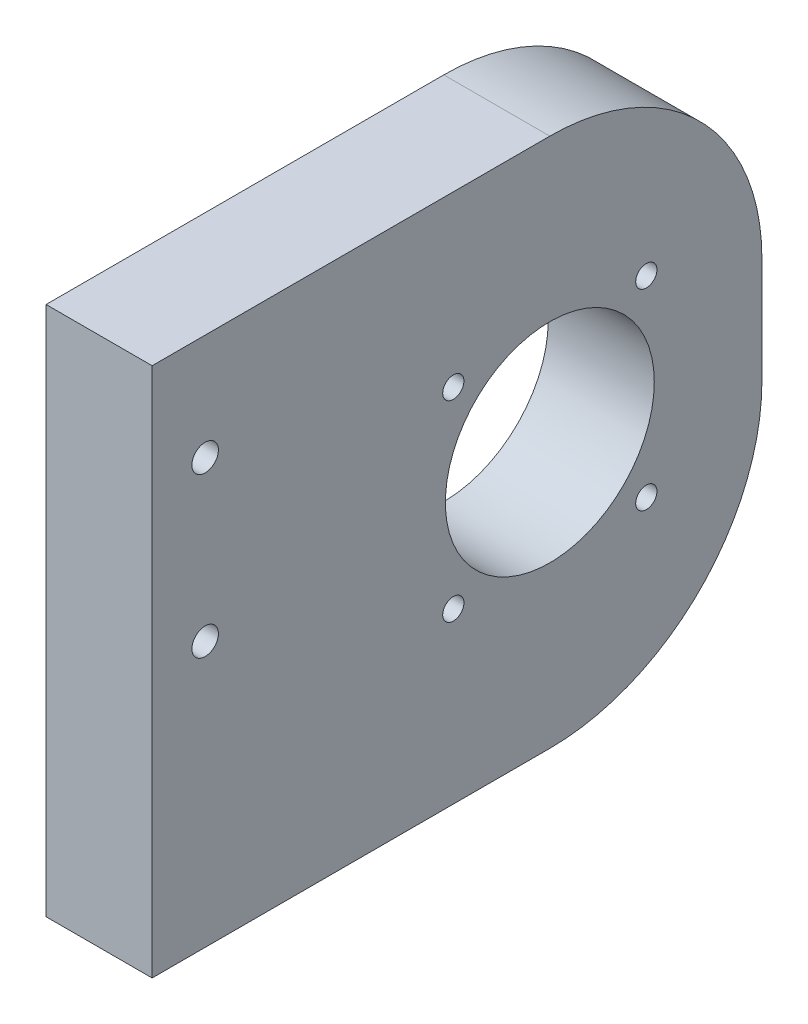
ISO-10303-21;
HEADER;
FILE_DESCRIPTION(('STEP AP214'),'2;1');
FILE_NAME('part.step','',(''),(''),'','','');
FILE_SCHEMA(('AUTOMOTIVE_DESIGN { 1 0 10303 214 1 1 1 1 }'));
ENDSEC;
DATA;
#1=APPLICATION_CONTEXT('core data for automotive mechanical design processes');
#2=APPLICATION_PROTOCOL_DEFINITION('international standard','automotive_design',2000,#1);
#3=PRODUCT_CONTEXT('',#1,'mechanical');
#4=PRODUCT('Part','Part','',(#3));
#5=PRODUCT_RELATED_PRODUCT_CATEGORY('part','',(#4));
#6=PRODUCT_DEFINITION_FORMATION('','',#4);
#7=PRODUCT_DEFINITION_CONTEXT('part definition',#1,'design');
#8=PRODUCT_DEFINITION('design','',#6,#7);
#9=PRODUCT_DEFINITION_SHAPE('','',#8);
#10=(LENGTH_UNIT() NAMED_UNIT(*) SI_UNIT(.MILLI.,.METRE.));
#11=(NAMED_UNIT(*) PLANE_ANGLE_UNIT() SI_UNIT($,.RADIAN.));
#12=(NAMED_UNIT(*) SI_UNIT($,.STERADIAN.) SOLID_ANGLE_UNIT());
#13=UNCERTAINTY_MEASURE_WITH_UNIT(LENGTH_MEASURE(1.E-05),#10,'distance_accuracy_value','');
#14=(GEOMETRIC_REPRESENTATION_CONTEXT(3) GLOBAL_UNCERTAINTY_ASSIGNED_CONTEXT((#13)) GLOBAL_UNIT_ASSIGNED_CONTEXT((#10,
#11,#12)) REPRESENTATION_CONTEXT('',''));
#15=CARTESIAN_POINT('',(0.,0.,0.));
#16=DIRECTION('',(0.,0.,1.));
#17=DIRECTION('',(1.,0.,0.));
#18=AXIS2_PLACEMENT_3D('',#15,#16,#17);
#19=CARTESIAN_POINT('',(0.,0.,146.05));
#20=DIRECTION('',(1.,0.,0.));
#21=DIRECTION('',(0.,0.,-1.));
#22=AXIS2_PLACEMENT_3D('',#19,#20,#21);
#23=PLANE('',#22);
#24=CARTESIAN_POINT('',(0.,101.6,133.35));
#25=DIRECTION('',(1.,0.,0.));
#26=DIRECTION('',(0.,0.,-1.));
#27=AXIS2_PLACEMENT_3D('',#24,#25,#26);
#28=CIRCLE('',#27,3.175);
#29=CARTESIAN_POINT('',(0.,101.6,130.175));
#30=VERTEX_POINT('',#29);
#31=EDGE_CURVE('E154',#30,#30,#28,.F.);
#32=ORIENTED_EDGE('',*,*,#31,.F.);
#33=EDGE_LOOP('',(#32));
#34=FACE_BOUND('',#33,.T.);
#35=CARTESIAN_POINT('',(0.,40.513,73.914));
#36=DIRECTION('',(1.,0.,0.));
#37=DIRECTION('',(0.,0.,-1.));
#38=AXIS2_PLACEMENT_3D('',#35,#36,#37);
#39=CIRCLE('',#38,2.54);
#40=CARTESIAN_POINT('',(0.,40.513,71.374));
#41=VERTEX_POINT('',#40);
#42=EDGE_CURVE('E194',#41,#41,#39,.F.);
#43=ORIENTED_EDGE('',*,*,#42,.F.);
#44=EDGE_LOOP('',(#43));
#45=FACE_BOUND('',#44,.T.);
#46=CARTESIAN_POINT('',(0.,40.513,27.686));
#47=DIRECTION('',(1.,0.,0.));
#48=DIRECTION('',(0.,0.,-1.));
#49=AXIS2_PLACEMENT_3D('',#46,#47,#48);
#50=CIRCLE('',#49,2.54);
#51=CARTESIAN_POINT('',(0.,40.513,25.146));
#52=VERTEX_POINT('',#51);
#53=EDGE_CURVE('E189',#52,#52,#50,.F.);
#54=ORIENTED_EDGE('',*,*,#53,.F.);
#55=EDGE_LOOP('',(#54));
#56=FACE_BOUND('',#55,.T.);
#57=CARTESIAN_POINT('',(0.,63.5,133.35));
#58=DIRECTION('',(1.,0.,0.));
#59=DIRECTION('',(0.,0.,-1.));
#60=AXIS2_PLACEMENT_3D('',#57,#58,#59);
#61=CIRCLE('',#60,3.175);
#62=CARTESIAN_POINT('',(0.,63.5,130.175));
#63=VERTEX_POINT('',#62);
#64=EDGE_CURVE('E176',#63,#63,#61,.F.);
#65=ORIENTED_EDGE('',*,*,#64,.F.);
#66=EDGE_LOOP('',(#65));
#67=FACE_BOUND('',#66,.T.);
#68=CARTESIAN_POINT('',(0.,63.5,50.8));
#69=DIRECTION('',(1.,0.,0.));
#70=DIRECTION('',(0.,0.,-1.));
#71=AXIS2_PLACEMENT_3D('',#68,#69,#70);
#72=CIRCLE('',#71,25.019);
#73=CARTESIAN_POINT('',(0.,63.5,25.781));
#74=VERTEX_POINT('',#73);
#75=EDGE_CURVE('E168',#74,#74,#72,.F.);
#76=ORIENTED_EDGE('',*,*,#75,.F.);
#77=EDGE_LOOP('',(#76));
#78=FACE_BOUND('',#77,.T.);
#79=CARTESIAN_POINT('',(0.,86.487,73.914));
#80=DIRECTION('',(1.,0.,0.));
#81=DIRECTION('',(0.,0.,-1.));
#82=AXIS2_PLACEMENT_3D('',#79,#80,#81);
#83=CIRCLE('',#82,2.53999999999999);
#84=CARTESIAN_POINT('',(0.,86.487,71.374));
#85=VERTEX_POINT('',#84);
#86=EDGE_CURVE('E175',#85,#85,#83,.F.);
#87=ORIENTED_EDGE('',*,*,#86,.F.);
#88=EDGE_LOOP('',(#87));
#89=FACE_BOUND('',#88,.T.);
#90=CARTESIAN_POINT('',(0.,86.487,27.686));
#91=DIRECTION('',(1.,0.,0.));
#92=DIRECTION('',(0.,0.,-1.));
#93=AXIS2_PLACEMENT_3D('',#90,#91,#92);
#94=CIRCLE('',#93,2.54);
#95=CARTESIAN_POINT('',(0.,86.487,25.146));
#96=VERTEX_POINT('',#95);
#97=EDGE_CURVE('E182',#96,#96,#94,.F.);
#98=ORIENTED_EDGE('',*,*,#97,.F.);
#99=EDGE_LOOP('',(#98));
#100=FACE_BOUND('',#99,.T.);
#101=DIRECTION('',(0.,-1.,0.));
#102=VECTOR('',#101,1.);
#103=CARTESIAN_POINT('',(0.,0.,0.));
#104=LINE('',#103,#102);
#105=CARTESIAN_POINT('',(0.,76.2,0.));
#106=VERTEX_POINT('',#105);
#107=CARTESIAN_POINT('',(0.,50.8,0.));
#108=VERTEX_POINT('',#107);
#109=EDGE_CURVE('E150',#106,#108,#104,.T.);
#110=ORIENTED_EDGE('',*,*,#109,.T.);
#111=CARTESIAN_POINT('',(0.,50.8,50.8));
#112=DIRECTION('',(1.,0.,0.));
#113=DIRECTION('',(0.,0.,-1.));
#114=AXIS2_PLACEMENT_3D('',#111,#112,#113);
#115=CIRCLE('',#114,50.8);
#116=CARTESIAN_POINT('',(0.,0.,50.8));
#117=VERTEX_POINT('',#116);
#118=EDGE_CURVE('E65',#108,#117,#115,.F.);
#119=ORIENTED_EDGE('',*,*,#118,.T.);
#120=DIRECTION('',(0.,0.,-1.));
#121=VECTOR('',#120,1.);
#122=CARTESIAN_POINT('',(0.,0.,146.05));
#123=LINE('',#122,#121);
#124=CARTESIAN_POINT('',(0.,0.,146.05));
#125=VERTEX_POINT('',#124);
#126=EDGE_CURVE('E117',#125,#117,#123,.T.);
#127=ORIENTED_EDGE('',*,*,#126,.F.);
#128=DIRECTION('',(0.,-1.,0.));
#129=VECTOR('',#128,1.);
#130=CARTESIAN_POINT('',(0.,0.,146.05));
#131=LINE('',#130,#129);
#132=CARTESIAN_POINT('',(0.,127.,146.05));
#133=VERTEX_POINT('',#132);
#134=EDGE_CURVE('E124',#133,#125,#131,.T.);
#135=ORIENTED_EDGE('',*,*,#134,.F.);
#136=DIRECTION('',(0.,0.,-1.));
#137=VECTOR('',#136,1.);
#138=CARTESIAN_POINT('',(0.,127.,146.05));
#139=LINE('',#138,#137);
#140=CARTESIAN_POINT('',(0.,127.,50.8));
#141=VERTEX_POINT('',#140);
#142=EDGE_CURVE('E151',#133,#141,#139,.T.);
#143=ORIENTED_EDGE('',*,*,#142,.T.);
#144=CARTESIAN_POINT('',(0.,76.2,50.8));
#145=DIRECTION('',(1.,0.,0.));
#146=DIRECTION('',(0.,0.,-1.));
#147=AXIS2_PLACEMENT_3D('',#144,#145,#146);
#148=CIRCLE('',#147,50.8);
#149=EDGE_CURVE('E72',#141,#106,#148,.F.);
#150=ORIENTED_EDGE('',*,*,#149,.T.);
#151=EDGE_LOOP('',(#110,#119,#127,#135,#143,#150));
#152=FACE_BOUND('',#151,.T.);
#153=ADVANCED_FACE('F57',(#34,#45,#56,#67,#78,#89,#100,#152),#23,.F.);
#154=CARTESIAN_POINT('',(0.,0.,146.05));
#155=DIRECTION('',(0.,1.,0.));
#156=DIRECTION('',(0.,0.,1.));
#157=AXIS2_PLACEMENT_3D('',#154,#155,#156);
#158=PLANE('',#157);
#159=ORIENTED_EDGE('',*,*,#126,.T.);
#160=DIRECTION('',(1.,0.,0.));
#161=VECTOR('',#160,1.);
#162=CARTESIAN_POINT('',(25.4,0.,50.8));
#163=LINE('',#162,#161);
#164=CARTESIAN_POINT('',(25.4,0.,50.8));
#165=VERTEX_POINT('',#164);
#166=EDGE_CURVE('E136',#117,#165,#163,.T.);
#167=ORIENTED_EDGE('',*,*,#166,.T.);
#168=DIRECTION('',(0.,0.,-1.));
#169=VECTOR('',#168,1.);
#170=CARTESIAN_POINT('',(25.4,0.,146.05));
#171=LINE('',#170,#169);
#172=CARTESIAN_POINT('',(25.4,0.,146.05));
#173=VERTEX_POINT('',#172);
#174=EDGE_CURVE('E120',#173,#165,#171,.T.);
#175=ORIENTED_EDGE('',*,*,#174,.F.);
#176=DIRECTION('',(1.,0.,0.));
#177=VECTOR('',#176,1.);
#178=CARTESIAN_POINT('',(0.,0.,146.05));
#179=LINE('',#178,#177);
#180=EDGE_CURVE('E112',#125,#173,#179,.T.);
#181=ORIENTED_EDGE('',*,*,#180,.F.);
#182=EDGE_LOOP('',(#159,#167,#175,#181));
#183=FACE_BOUND('',#182,.T.);
#184=ADVANCED_FACE('F114',(#183),#158,.F.);
#185=CARTESIAN_POINT('',(25.4,0.,146.05));
#186=DIRECTION('',(-1.,0.,0.));
#187=DIRECTION('',(0.,0.,1.));
#188=AXIS2_PLACEMENT_3D('',#185,#186,#187);
#189=PLANE('',#188);
#190=CARTESIAN_POINT('',(25.4,101.6,133.35));
#191=DIRECTION('',(1.,0.,0.));
#192=DIRECTION('',(0.,0.,-1.));
#193=AXIS2_PLACEMENT_3D('',#190,#191,#192);
#194=CIRCLE('',#193,3.175);
#195=CARTESIAN_POINT('',(25.4,101.6,130.175));
#196=VERTEX_POINT('',#195);
#197=EDGE_CURVE('E179',#196,#196,#194,.T.);
#198=ORIENTED_EDGE('',*,*,#197,.F.);
#199=EDGE_LOOP('',(#198));
#200=FACE_BOUND('',#199,.T.);
#201=CARTESIAN_POINT('',(25.4,40.513,73.914));
#202=DIRECTION('',(1.,0.,0.));
#203=DIRECTION('',(0.,0.,-1.));
#204=AXIS2_PLACEMENT_3D('',#201,#202,#203);
#205=CIRCLE('',#204,2.54);
#206=CARTESIAN_POINT('',(25.4,40.513,71.374));
#207=VERTEX_POINT('',#206);
#208=EDGE_CURVE('E198',#207,#207,#205,.T.);
#209=ORIENTED_EDGE('',*,*,#208,.F.);
#210=EDGE_LOOP('',(#209));
#211=FACE_BOUND('',#210,.T.);
#212=CARTESIAN_POINT('',(25.4,40.513,27.686));
#213=DIRECTION('',(1.,0.,0.));
#214=DIRECTION('',(0.,0.,-1.));
#215=AXIS2_PLACEMENT_3D('',#212,#213,#214);
#216=CIRCLE('',#215,2.54);
#217=CARTESIAN_POINT('',(25.4,40.513,25.146));
#218=VERTEX_POINT('',#217);
#219=EDGE_CURVE('E197',#218,#218,#216,.T.);
#220=ORIENTED_EDGE('',*,*,#219,.F.);
#221=EDGE_LOOP('',(#220));
#222=FACE_BOUND('',#221,.T.);
#223=CARTESIAN_POINT('',(25.4,63.5,133.35));
#224=DIRECTION('',(1.,0.,0.));
#225=DIRECTION('',(0.,0.,-1.));
#226=AXIS2_PLACEMENT_3D('',#223,#224,#225);
#227=CIRCLE('',#226,3.175);
#228=CARTESIAN_POINT('',(25.4,63.5,130.175));
#229=VERTEX_POINT('',#228);
#230=EDGE_CURVE('E171',#229,#229,#227,.T.);
#231=ORIENTED_EDGE('',*,*,#230,.F.);
#232=EDGE_LOOP('',(#231));
#233=FACE_BOUND('',#232,.T.);
#234=CARTESIAN_POINT('',(25.4,63.5,50.8));
#235=DIRECTION('',(1.,0.,0.));
#236=DIRECTION('',(0.,0.,-1.));
#237=AXIS2_PLACEMENT_3D('',#234,#235,#236);
#238=CIRCLE('',#237,25.019);
#239=CARTESIAN_POINT('',(25.4,63.5,25.781));
#240=VERTEX_POINT('',#239);
#241=EDGE_CURVE('E172',#240,#240,#238,.T.);
#242=ORIENTED_EDGE('',*,*,#241,.F.);
#243=EDGE_LOOP('',(#242));
#244=FACE_BOUND('',#243,.T.);
#245=CARTESIAN_POINT('',(25.4,86.487,73.914));
#246=DIRECTION('',(1.,0.,0.));
#247=DIRECTION('',(0.,0.,-1.));
#248=AXIS2_PLACEMENT_3D('',#245,#246,#247);
#249=CIRCLE('',#248,2.53999999999999);
#250=CARTESIAN_POINT('',(25.4,86.487,71.374));
#251=VERTEX_POINT('',#250);
#252=EDGE_CURVE('E185',#251,#251,#249,.T.);
#253=ORIENTED_EDGE('',*,*,#252,.F.);
#254=EDGE_LOOP('',(#253));
#255=FACE_BOUND('',#254,.T.);
#256=CARTESIAN_POINT('',(25.4,86.487,27.686));
#257=DIRECTION('',(1.,0.,0.));
#258=DIRECTION('',(0.,0.,-1.));
#259=AXIS2_PLACEMENT_3D('',#256,#257,#258);
#260=CIRCLE('',#259,2.54);
#261=CARTESIAN_POINT('',(25.4,86.487,25.146));
#262=VERTEX_POINT('',#261);
#263=EDGE_CURVE('E186',#262,#262,#260,.T.);
#264=ORIENTED_EDGE('',*,*,#263,.F.);
#265=EDGE_LOOP('',(#264));
#266=FACE_BOUND('',#265,.T.);
#267=ORIENTED_EDGE('',*,*,#174,.T.);
#268=CARTESIAN_POINT('',(25.4,50.8,50.8));
#269=DIRECTION('',(-1.,0.,0.));
#270=DIRECTION('',(0.,0.,1.));
#271=AXIS2_PLACEMENT_3D('',#268,#269,#270);
#272=CIRCLE('',#271,50.8);
#273=CARTESIAN_POINT('',(25.4,50.8,0.));
#274=VERTEX_POINT('',#273);
#275=EDGE_CURVE('E145',#165,#274,#272,.F.);
#276=ORIENTED_EDGE('',*,*,#275,.T.);
#277=DIRECTION('',(0.,1.,0.));
#278=VECTOR('',#277,1.);
#279=CARTESIAN_POINT('',(25.4,0.,0.));
#280=LINE('',#279,#278);
#281=CARTESIAN_POINT('',(25.4,76.2,0.));
#282=VERTEX_POINT('',#281);
#283=EDGE_CURVE('E133',#274,#282,#280,.T.);
#284=ORIENTED_EDGE('',*,*,#283,.T.);
#285=CARTESIAN_POINT('',(25.4,76.2,50.8));
#286=DIRECTION('',(-1.,0.,0.));
#287=DIRECTION('',(0.,0.,1.));
#288=AXIS2_PLACEMENT_3D('',#285,#286,#287);
#289=CIRCLE('',#288,50.8);
#290=CARTESIAN_POINT('',(25.4,127.,50.8));
#291=VERTEX_POINT('',#290);
#292=EDGE_CURVE('E138',#282,#291,#289,.F.);
#293=ORIENTED_EDGE('',*,*,#292,.T.);
#294=DIRECTION('',(0.,0.,-1.));
#295=VECTOR('',#294,1.);
#296=CARTESIAN_POINT('',(25.4,127.,146.05));
#297=LINE('',#296,#295);
#298=CARTESIAN_POINT('',(25.4,127.,146.05));
#299=VERTEX_POINT('',#298);
#300=EDGE_CURVE('E140',#299,#291,#297,.T.);
#301=ORIENTED_EDGE('',*,*,#300,.F.);
#302=DIRECTION('',(0.,1.,0.));
#303=VECTOR('',#302,1.);
#304=CARTESIAN_POINT('',(25.4,0.,146.05));
#305=LINE('',#304,#303);
#306=EDGE_CURVE('E123',#173,#299,#305,.T.);
#307=ORIENTED_EDGE('',*,*,#306,.F.);
#308=EDGE_LOOP('',(#267,#276,#284,#293,#301,#307));
#309=FACE_BOUND('',#308,.T.);
#310=ADVANCED_FACE('F160',(#200,#211,#222,#233,#244,#255,#266,#309),#189,.F.);
#311=CARTESIAN_POINT('',(0.,127.,146.05));
#312=DIRECTION('',(0.,-1.,0.));
#313=DIRECTION('',(0.,0.,-1.));
#314=AXIS2_PLACEMENT_3D('',#311,#312,#313);
#315=PLANE('',#314);
#316=ORIENTED_EDGE('',*,*,#300,.T.);
#317=DIRECTION('',(-1.,0.,0.));
#318=VECTOR('',#317,1.);
#319=CARTESIAN_POINT('',(0.,127.,50.8));
#320=LINE('',#319,#318);
#321=EDGE_CURVE('E12',#291,#141,#320,.T.);
#322=ORIENTED_EDGE('',*,*,#321,.T.);
#323=ORIENTED_EDGE('',*,*,#142,.F.);
#324=DIRECTION('',(-1.,0.,0.));
#325=VECTOR('',#324,1.);
#326=CARTESIAN_POINT('',(0.,127.,146.05));
#327=LINE('',#326,#325);
#328=EDGE_CURVE('E129',#299,#133,#327,.T.);
#329=ORIENTED_EDGE('',*,*,#328,.F.);
#330=EDGE_LOOP('',(#316,#322,#323,#329));
#331=FACE_BOUND('',#330,.T.);
#332=ADVANCED_FACE('F162',(#331),#315,.F.);
#333=CARTESIAN_POINT('',(0.,0.,146.05));
#334=DIRECTION('',(0.,0.,-1.));
#335=DIRECTION('',(-1.,0.,0.));
#336=AXIS2_PLACEMENT_3D('',#333,#334,#335);
#337=PLANE('',#336);
#338=ORIENTED_EDGE('',*,*,#134,.T.);
#339=ORIENTED_EDGE('',*,*,#180,.T.);
#340=ORIENTED_EDGE('',*,*,#306,.T.);
#341=ORIENTED_EDGE('',*,*,#328,.T.);
#342=EDGE_LOOP('',(#338,#339,#340,#341));
#343=FACE_BOUND('',#342,.T.);
#344=ADVANCED_FACE('F127',(#343),#337,.F.);
#345=CARTESIAN_POINT('',(0.,0.,0.));
#346=DIRECTION('',(0.,0.,-1.));
#347=DIRECTION('',(-1.,0.,0.));
#348=AXIS2_PLACEMENT_3D('',#345,#346,#347);
#349=PLANE('',#348);
#350=ORIENTED_EDGE('',*,*,#283,.F.);
#351=DIRECTION('',(1.,0.,0.));
#352=VECTOR('',#351,1.);
#353=CARTESIAN_POINT('',(0.,50.8,0.));
#354=LINE('',#353,#352);
#355=EDGE_CURVE('E79',#274,#108,#354,.F.);
#356=ORIENTED_EDGE('',*,*,#355,.T.);
#357=ORIENTED_EDGE('',*,*,#109,.F.);
#358=DIRECTION('',(-1.,0.,0.));
#359=VECTOR('',#358,1.);
#360=CARTESIAN_POINT('',(25.4,76.2,0.));
#361=LINE('',#360,#359);
#362=EDGE_CURVE('E147',#106,#282,#361,.F.);
#363=ORIENTED_EDGE('',*,*,#362,.T.);
#364=EDGE_LOOP('',(#350,#356,#357,#363));
#365=FACE_BOUND('',#364,.T.);
#366=ADVANCED_FACE('F152',(#365),#349,.T.);
#367=CARTESIAN_POINT('',(0.,50.8,50.8));
#368=DIRECTION('',(-1.,0.,0.));
#369=DIRECTION('',(0.,0.,1.));
#370=AXIS2_PLACEMENT_3D('',#367,#368,#369);
#371=CYLINDRICAL_SURFACE('',#370,50.8);
#372=ORIENTED_EDGE('',*,*,#118,.F.);
#373=ORIENTED_EDGE('',*,*,#355,.F.);
#374=ORIENTED_EDGE('',*,*,#275,.F.);
#375=ORIENTED_EDGE('',*,*,#166,.F.);
#376=EDGE_LOOP('',(#372,#373,#374,#375));
#377=FACE_BOUND('',#376,.T.);
#378=ADVANCED_FACE('F239',(#377),#371,.T.);
#379=CARTESIAN_POINT('',(0.,76.2,50.8));
#380=DIRECTION('',(1.,0.,0.));
#381=DIRECTION('',(0.,0.,-1.));
#382=AXIS2_PLACEMENT_3D('',#379,#380,#381);
#383=CYLINDRICAL_SURFACE('',#382,50.8);
#384=ORIENTED_EDGE('',*,*,#292,.F.);
#385=ORIENTED_EDGE('',*,*,#362,.F.);
#386=ORIENTED_EDGE('',*,*,#149,.F.);
#387=ORIENTED_EDGE('',*,*,#321,.F.);
#388=EDGE_LOOP('',(#384,#385,#386,#387));
#389=FACE_BOUND('',#388,.T.);
#390=ADVANCED_FACE('F59',(#389),#383,.T.);
#391=CARTESIAN_POINT('',(-70.7644182340249,86.487,27.686));
#392=DIRECTION('',(1.,0.,0.));
#393=DIRECTION('',(0.,0.,-1.));
#394=AXIS2_PLACEMENT_3D('',#391,#392,#393);
#395=CYLINDRICAL_SURFACE('',#394,2.54);
#396=ORIENTED_EDGE('',*,*,#97,.T.);
#397=EDGE_LOOP('',(#396));
#398=FACE_BOUND('',#397,.T.);
#399=ORIENTED_EDGE('',*,*,#263,.T.);
#400=EDGE_LOOP('',(#399));
#401=FACE_BOUND('',#400,.T.);
#402=ADVANCED_FACE('F227',(#398,#401),#395,.F.);
#403=CARTESIAN_POINT('',(-70.7644182340249,86.487,73.914));
#404=DIRECTION('',(1.,0.,0.));
#405=DIRECTION('',(0.,0.,-1.));
#406=AXIS2_PLACEMENT_3D('',#403,#404,#405);
#407=CYLINDRICAL_SURFACE('',#406,2.53999999999999);
#408=ORIENTED_EDGE('',*,*,#86,.T.);
#409=EDGE_LOOP('',(#408));
#410=FACE_BOUND('',#409,.T.);
#411=ORIENTED_EDGE('',*,*,#252,.T.);
#412=EDGE_LOOP('',(#411));
#413=FACE_BOUND('',#412,.T.);
#414=ADVANCED_FACE('F229',(#410,#413),#407,.F.);
#415=CARTESIAN_POINT('',(-70.7644182340249,63.5,50.8));
#416=DIRECTION('',(1.,0.,0.));
#417=DIRECTION('',(0.,0.,-1.));
#418=AXIS2_PLACEMENT_3D('',#415,#416,#417);
#419=CYLINDRICAL_SURFACE('',#418,25.019);
#420=ORIENTED_EDGE('',*,*,#75,.T.);
#421=EDGE_LOOP('',(#420));
#422=FACE_BOUND('',#421,.T.);
#423=ORIENTED_EDGE('',*,*,#241,.T.);
#424=EDGE_LOOP('',(#423));
#425=FACE_BOUND('',#424,.T.);
#426=ADVANCED_FACE('F236',(#422,#425),#419,.F.);
#427=CARTESIAN_POINT('',(-70.7644182340249,63.5,133.35));
#428=DIRECTION('',(1.,0.,0.));
#429=DIRECTION('',(0.,0.,-1.));
#430=AXIS2_PLACEMENT_3D('',#427,#428,#429);
#431=CYLINDRICAL_SURFACE('',#430,3.175);
#432=ORIENTED_EDGE('',*,*,#64,.T.);
#433=EDGE_LOOP('',(#432));
#434=FACE_BOUND('',#433,.T.);
#435=ORIENTED_EDGE('',*,*,#230,.T.);
#436=EDGE_LOOP('',(#435));
#437=FACE_BOUND('',#436,.T.);
#438=ADVANCED_FACE('F309',(#434,#437),#431,.F.);
#439=CARTESIAN_POINT('',(-70.7644182340249,40.513,27.686));
#440=DIRECTION('',(1.,0.,0.));
#441=DIRECTION('',(0.,0.,-1.));
#442=AXIS2_PLACEMENT_3D('',#439,#440,#441);
#443=CYLINDRICAL_SURFACE('',#442,2.54);
#444=ORIENTED_EDGE('',*,*,#53,.T.);
#445=EDGE_LOOP('',(#444));
#446=FACE_BOUND('',#445,.T.);
#447=ORIENTED_EDGE('',*,*,#219,.T.);
#448=EDGE_LOOP('',(#447));
#449=FACE_BOUND('',#448,.T.);
#450=ADVANCED_FACE('F318',(#446,#449),#443,.F.);
#451=CARTESIAN_POINT('',(-70.7644182340249,40.513,73.914));
#452=DIRECTION('',(1.,0.,0.));
#453=DIRECTION('',(0.,0.,-1.));
#454=AXIS2_PLACEMENT_3D('',#451,#452,#453);
#455=CYLINDRICAL_SURFACE('',#454,2.54);
#456=ORIENTED_EDGE('',*,*,#42,.T.);
#457=EDGE_LOOP('',(#456));
#458=FACE_BOUND('',#457,.T.);
#459=ORIENTED_EDGE('',*,*,#208,.T.);
#460=EDGE_LOOP('',(#459));
#461=FACE_BOUND('',#460,.T.);
#462=ADVANCED_FACE('F327',(#458,#461),#455,.F.);
#463=CARTESIAN_POINT('',(-70.7644182340249,101.6,133.35));
#464=DIRECTION('',(1.,0.,0.));
#465=DIRECTION('',(0.,0.,-1.));
#466=AXIS2_PLACEMENT_3D('',#463,#464,#465);
#467=CYLINDRICAL_SURFACE('',#466,3.175);
#468=ORIENTED_EDGE('',*,*,#31,.T.);
#469=EDGE_LOOP('',(#468));
#470=FACE_BOUND('',#469,.T.);
#471=ORIENTED_EDGE('',*,*,#197,.T.);
#472=EDGE_LOOP('',(#471));
#473=FACE_BOUND('',#472,.T.);
#474=ADVANCED_FACE('F210',(#470,#473),#467,.F.);
#475=CLOSED_SHELL('',(#153,#184,#310,#332,#344,#366,#378,#390,#402,#414,#426,#438,#450,#462,#474));
#476=MANIFOLD_SOLID_BREP('B2',#475);
#477=ADVANCED_BREP_SHAPE_REPRESENTATION('',(#18,#476),#14);
#478=SHAPE_DEFINITION_REPRESENTATION(#9,#477);
ENDSEC;
END-ISO-10303-21;
